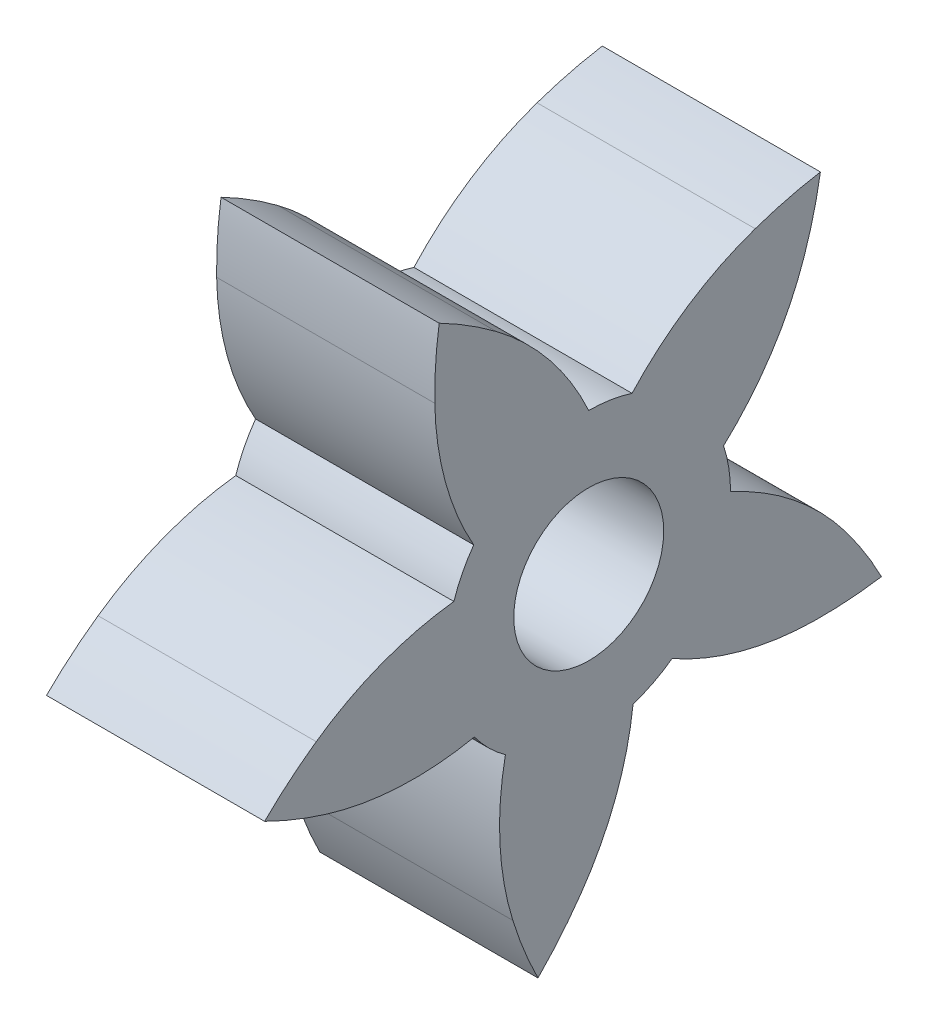
ISO-10303-21;
HEADER;
FILE_DESCRIPTION(('STEP AP214'),'2;1');
FILE_NAME('part.step','',(''),(''),'','','');
FILE_SCHEMA(('AUTOMOTIVE_DESIGN { 1 0 10303 214 1 1 1 1 }'));
ENDSEC;
DATA;
#1=APPLICATION_CONTEXT('core data for automotive mechanical design processes');
#2=APPLICATION_PROTOCOL_DEFINITION('international standard','automotive_design',2000,#1);
#3=PRODUCT_CONTEXT('',#1,'mechanical');
#4=PRODUCT('Part','Part','',(#3));
#5=PRODUCT_RELATED_PRODUCT_CATEGORY('part','',(#4));
#6=PRODUCT_DEFINITION_FORMATION('','',#4);
#7=PRODUCT_DEFINITION_CONTEXT('part definition',#1,'design');
#8=PRODUCT_DEFINITION('design','',#6,#7);
#9=PRODUCT_DEFINITION_SHAPE('','',#8);
#10=(LENGTH_UNIT() NAMED_UNIT(*) SI_UNIT(.MILLI.,.METRE.));
#11=(NAMED_UNIT(*) PLANE_ANGLE_UNIT() SI_UNIT($,.RADIAN.));
#12=(NAMED_UNIT(*) SI_UNIT($,.STERADIAN.) SOLID_ANGLE_UNIT());
#13=UNCERTAINTY_MEASURE_WITH_UNIT(LENGTH_MEASURE(1.E-05),#10,'distance_accuracy_value','');
#14=(GEOMETRIC_REPRESENTATION_CONTEXT(3) GLOBAL_UNCERTAINTY_ASSIGNED_CONTEXT((#13)) GLOBAL_UNIT_ASSIGNED_CONTEXT((#10,
#11,#12)) REPRESENTATION_CONTEXT('',''));
#15=CARTESIAN_POINT('',(0.,0.,0.));
#16=DIRECTION('',(0.,0.,1.));
#17=DIRECTION('',(1.,0.,0.));
#18=AXIS2_PLACEMENT_3D('',#15,#16,#17);
#19=CARTESIAN_POINT('',(-4.,-5.97317024184142,-10.9089907349344));
#20=DIRECTION('',(1.,0.,0.));
#21=DIRECTION('',(0.,0.,-1.));
#22=AXIS2_PLACEMENT_3D('',#19,#20,#21);
#23=CYLINDRICAL_SURFACE('',#22,14.7008999465529);
#24=DIRECTION('',(1.,0.,0.));
#25=VECTOR('',#24,1.);
#26=CARTESIAN_POINT('',(-4.,7.92049634769369,-6.10456694665368));
#27=LINE('',#26,#25);
#28=CARTESIAN_POINT('',(-4.,7.92049634769369,-6.10456694665368));
#29=VERTEX_POINT('',#28);
#30=CARTESIAN_POINT('',(4.,7.92049634769369,-6.10456694665368));
#31=VERTEX_POINT('',#30);
#32=EDGE_CURVE('E36',#29,#31,#27,.T.);
#33=ORIENTED_EDGE('',*,*,#32,.T.);
#34=CARTESIAN_POINT('',(4.,-5.97317024184142,-10.9089907349344));
#35=DIRECTION('',(1.,0.,0.));
#36=DIRECTION('',(0.,0.,1.));
#37=AXIS2_PLACEMENT_3D('',#34,#35,#36);
#38=CIRCLE('',#37,14.7008999465529);
#39=CARTESIAN_POINT('',(4.,8.5284493631852,-8.49662922188018));
#40=VERTEX_POINT('',#39);
#41=EDGE_CURVE('E199',#40,#31,#38,.T.);
#42=ORIENTED_EDGE('',*,*,#41,.F.);
#43=DIRECTION('',(1.,0.,0.));
#44=VECTOR('',#43,1.);
#45=CARTESIAN_POINT('',(-4.,8.5284493631852,-8.49662922188018));
#46=LINE('',#45,#44);
#47=CARTESIAN_POINT('',(-4.,8.5284493631852,-8.49662922188018));
#48=VERTEX_POINT('',#47);
#49=EDGE_CURVE('E11',#48,#40,#46,.T.);
#50=ORIENTED_EDGE('',*,*,#49,.F.);
#51=CARTESIAN_POINT('',(-4.,-5.97317024184142,-10.9089907349344));
#52=DIRECTION('',(1.,0.,0.));
#53=DIRECTION('',(0.,0.,1.));
#54=AXIS2_PLACEMENT_3D('',#51,#52,#53);
#55=CIRCLE('',#54,14.7008999465529);
#56=EDGE_CURVE('E200',#48,#29,#55,.T.);
#57=ORIENTED_EDGE('',*,*,#56,.T.);
#58=EDGE_LOOP('',(#33,#42,#50,#57));
#59=FACE_BOUND('',#58,.T.);
#60=ADVANCED_FACE('F33',(#59),#23,.T.);
#61=CARTESIAN_POINT('',(-4.,10.8865866987636,6.0139065209899));
#62=DIRECTION('',(1.,0.,0.));
#63=DIRECTION('',(0.,0.,-1.));
#64=AXIS2_PLACEMENT_3D('',#61,#62,#63);
#65=CYLINDRICAL_SURFACE('',#64,14.7008999465529);
#66=ORIENTED_EDGE('',*,*,#49,.T.);
#67=CARTESIAN_POINT('',(4.,10.8865866987636,6.0139065209899));
#68=DIRECTION('',(1.,0.,0.));
#69=DIRECTION('',(0.,0.,-1.));
#70=AXIS2_PLACEMENT_3D('',#67,#68,#69);
#71=CIRCLE('',#70,14.7008999465529);
#72=CARTESIAN_POINT('',(4.,6.1341312602249,-7.89762202706193));
#73=VERTEX_POINT('',#72);
#74=EDGE_CURVE('E218',#73,#40,#71,.T.);
#75=ORIENTED_EDGE('',*,*,#74,.F.);
#76=DIRECTION('',(1.,0.,0.));
#77=VECTOR('',#76,1.);
#78=CARTESIAN_POINT('',(-4.,6.1341312602249,-7.89762202706193));
#79=LINE('',#78,#77);
#80=CARTESIAN_POINT('',(-4.,6.1341312602249,-7.89762202706193));
#81=VERTEX_POINT('',#80);
#82=EDGE_CURVE('E41',#81,#73,#79,.T.);
#83=ORIENTED_EDGE('',*,*,#82,.F.);
#84=CARTESIAN_POINT('',(-4.,10.8865866987636,6.0139065209899));
#85=DIRECTION('',(1.,0.,0.));
#86=DIRECTION('',(0.,0.,-1.));
#87=AXIS2_PLACEMENT_3D('',#84,#85,#86);
#88=CIRCLE('',#87,14.7008999465529);
#89=EDGE_CURVE('E205',#81,#48,#88,.T.);
#90=ORIENTED_EDGE('',*,*,#89,.T.);
#91=EDGE_LOOP('',(#66,#75,#83,#90));
#92=FACE_BOUND('',#91,.T.);
#93=ADVANCED_FACE('F492',(#92),#65,.T.);
#94=CARTESIAN_POINT('',(-4.,9.68405324180499,2.4938149109124));
#95=DIRECTION('',(1.,0.,0.));
#96=DIRECTION('',(0.,0.,-1.));
#97=AXIS2_PLACEMENT_3D('',#94,#95,#96);
#98=CYLINDRICAL_SURFACE('',#97,10.981070426475);
#99=ORIENTED_EDGE('',*,*,#82,.T.);
#100=CARTESIAN_POINT('',(4.,9.68405324180499,2.4938149109124));
#101=DIRECTION('',(1.,0.,0.));
#102=DIRECTION('',(0.,0.,-1.));
#103=AXIS2_PLACEMENT_3D('',#100,#101,#102);
#104=CIRCLE('',#103,10.981070426475);
#105=CARTESIAN_POINT('',(4.,1.60688837074984,-4.94549388473479));
#106=VERTEX_POINT('',#105);
#107=EDGE_CURVE('E285',#106,#73,#104,.T.);
#108=ORIENTED_EDGE('',*,*,#107,.F.);
#109=DIRECTION('',(1.,0.,0.));
#110=VECTOR('',#109,1.);
#111=CARTESIAN_POINT('',(-4.,1.60688837074984,-4.94549388473479));
#112=LINE('',#111,#110);
#113=CARTESIAN_POINT('',(-4.,1.60688837074984,-4.94549388473479));
#114=VERTEX_POINT('',#113);
#115=EDGE_CURVE('E361',#114,#106,#112,.T.);
#116=ORIENTED_EDGE('',*,*,#115,.F.);
#117=CARTESIAN_POINT('',(-4.,9.68405324180499,2.4938149109124));
#118=DIRECTION('',(1.,0.,0.));
#119=DIRECTION('',(0.,0.,-1.));
#120=AXIS2_PLACEMENT_3D('',#117,#118,#119);
#121=CIRCLE('',#120,10.981070426475);
#122=EDGE_CURVE('E357',#114,#81,#121,.T.);
#123=ORIENTED_EDGE('',*,*,#122,.T.);
#124=EDGE_LOOP('',(#99,#108,#116,#123));
#125=FACE_BOUND('',#124,.T.);
#126=ADVANCED_FACE('F490',(#125),#98,.T.);
#127=CARTESIAN_POINT('',(-4.,0.,0.));
#128=DIRECTION('',(1.,0.,0.));
#129=DIRECTION('',(0.,0.,-1.));
#130=AXIS2_PLACEMENT_3D('',#127,#128,#129);
#131=CYLINDRICAL_SURFACE('',#130,5.20000000000003);
#132=ORIENTED_EDGE('',*,*,#115,.T.);
#133=CARTESIAN_POINT('',(4.,0.,0.));
#134=DIRECTION('',(1.,0.,0.));
#135=DIRECTION('',(0.,0.,-1.));
#136=AXIS2_PLACEMENT_3D('',#133,#134,#135);
#137=CIRCLE('',#136,5.20000000000003);
#138=CARTESIAN_POINT('',(4.,0.0194376966845804,-5.19996367063729));
#139=VERTEX_POINT('',#138);
#140=EDGE_CURVE('E282',#139,#106,#137,.T.);
#141=ORIENTED_EDGE('',*,*,#140,.F.);
#142=DIRECTION('',(1.,0.,0.));
#143=VECTOR('',#142,1.);
#144=CARTESIAN_POINT('',(-4.,0.0194376966845804,-5.19996367063729));
#145=LINE('',#144,#143);
#146=CARTESIAN_POINT('',(-4.,0.0194376966845804,-5.19996367063729));
#147=VERTEX_POINT('',#146);
#148=EDGE_CURVE('E363',#147,#139,#145,.T.);
#149=ORIENTED_EDGE('',*,*,#148,.F.);
#150=CARTESIAN_POINT('',(-4.,0.,0.));
#151=DIRECTION('',(1.,0.,0.));
#152=DIRECTION('',(0.,0.,-1.));
#153=AXIS2_PLACEMENT_3D('',#150,#151,#152);
#154=CIRCLE('',#153,5.20000000000003);
#155=EDGE_CURVE('E354',#147,#114,#154,.T.);
#156=ORIENTED_EDGE('',*,*,#155,.T.);
#157=EDGE_LOOP('',(#132,#141,#149,#156));
#158=FACE_BOUND('',#157,.T.);
#159=ADVANCED_FACE('F486',(#158),#131,.T.);
#160=CARTESIAN_POINT('',(-4.,-9.97832291855498,-0.658081858924321));
#161=DIRECTION('',(1.,0.,0.));
#162=DIRECTION('',(0.,0.,-1.));
#163=AXIS2_PLACEMENT_3D('',#160,#161,#162);
#164=CYLINDRICAL_SURFACE('',#163,10.981070426475);
#165=ORIENTED_EDGE('',*,*,#148,.T.);
#166=CARTESIAN_POINT('',(4.,-9.97832291855498,-0.658081858924321));
#167=DIRECTION('',(1.,0.,0.));
#168=DIRECTION('',(0.,0.,-1.));
#169=AXIS2_PLACEMENT_3D('',#166,#167,#168);
#170=CIRCLE('',#169,10.981070426475);
#171=CARTESIAN_POINT('',(4.,-3.35822019845297,-9.4192545935816));
#172=VERTEX_POINT('',#171);
#173=EDGE_CURVE('E279',#172,#139,#170,.T.);
#174=ORIENTED_EDGE('',*,*,#173,.F.);
#175=DIRECTION('',(1.,0.,0.));
#176=VECTOR('',#175,1.);
#177=CARTESIAN_POINT('',(-4.,-3.35822019845297,-9.4192545935816));
#178=LINE('',#177,#176);
#179=CARTESIAN_POINT('',(-4.,-3.35822019845297,-9.4192545935816));
#180=VERTEX_POINT('',#179);
#181=EDGE_CURVE('E365',#180,#172,#178,.T.);
#182=ORIENTED_EDGE('',*,*,#181,.F.);
#183=CARTESIAN_POINT('',(-4.,-9.97832291855498,-0.658081858924321));
#184=DIRECTION('',(1.,0.,0.));
#185=DIRECTION('',(0.,0.,-1.));
#186=AXIS2_PLACEMENT_3D('',#183,#184,#185);
#187=CIRCLE('',#186,10.981070426475);
#188=EDGE_CURVE('E351',#180,#147,#187,.T.);
#189=ORIENTED_EDGE('',*,*,#188,.T.);
#190=EDGE_LOOP('',(#165,#174,#182,#189));
#191=FACE_BOUND('',#190,.T.);
#192=ADVANCED_FACE('F484',(#191),#164,.T.);
#193=CARTESIAN_POINT('',(-4.,-12.2208778396866,2.30975895286985));
#194=DIRECTION('',(1.,0.,0.));
#195=DIRECTION('',(0.,0.,-1.));
#196=AXIS2_PLACEMENT_3D('',#193,#194,#195);
#197=CYLINDRICAL_SURFACE('',#196,14.7008999465529);
#198=ORIENTED_EDGE('',*,*,#181,.T.);
#199=CARTESIAN_POINT('',(4.,-12.2208778396866,2.30975895286985));
#200=DIRECTION('',(1.,0.,0.));
#201=DIRECTION('',(0.,0.,1.));
#202=AXIS2_PLACEMENT_3D('',#199,#200,#201);
#203=CIRCLE('',#202,14.7008999465529);
#204=CARTESIAN_POINT('',(4.,-5.44533879912242,-10.7366401652144));
#205=VERTEX_POINT('',#204);
#206=EDGE_CURVE('E276',#205,#172,#203,.T.);
#207=ORIENTED_EDGE('',*,*,#206,.F.);
#208=DIRECTION('',(1.,0.,0.));
#209=VECTOR('',#208,1.);
#210=CARTESIAN_POINT('',(-4.,-5.44533879912242,-10.7366401652144));
#211=LINE('',#210,#209);
#212=CARTESIAN_POINT('',(-4.,-5.44533879912242,-10.7366401652144));
#213=VERTEX_POINT('',#212);
#214=EDGE_CURVE('E367',#213,#205,#211,.T.);
#215=ORIENTED_EDGE('',*,*,#214,.F.);
#216=CARTESIAN_POINT('',(-4.,-12.2208778396866,2.30975895286985));
#217=DIRECTION('',(1.,0.,0.));
#218=DIRECTION('',(0.,0.,1.));
#219=AXIS2_PLACEMENT_3D('',#216,#217,#218);
#220=CIRCLE('',#219,14.7008999465529);
#221=EDGE_CURVE('E348',#213,#180,#220,.T.);
#222=ORIENTED_EDGE('',*,*,#221,.T.);
#223=EDGE_LOOP('',(#198,#207,#215,#222));
#224=FACE_BOUND('',#223,.T.);
#225=ADVANCED_FACE('F479',(#224),#197,.T.);
#226=CARTESIAN_POINT('',(-4.,9.08370528583166,-8.49535990250298));
#227=DIRECTION('',(1.,0.,0.));
#228=DIRECTION('',(0.,0.,-1.));
#229=AXIS2_PLACEMENT_3D('',#226,#227,#228);
#230=CYLINDRICAL_SURFACE('',#229,14.7008999465529);
#231=ORIENTED_EDGE('',*,*,#214,.T.);
#232=CARTESIAN_POINT('',(4.,9.08370528583166,-8.49535990250298));
#233=DIRECTION('',(1.,0.,0.));
#234=DIRECTION('',(0.,0.,-1.));
#235=AXIS2_PLACEMENT_3D('',#232,#233,#234);
#236=CIRCLE('',#235,14.7008999465529);
#237=CARTESIAN_POINT('',(4.,-5.61553408693725,-8.27440492835881));
#238=VERTEX_POINT('',#237);
#239=EDGE_CURVE('E273',#238,#205,#236,.T.);
#240=ORIENTED_EDGE('',*,*,#239,.F.);
#241=DIRECTION('',(1.,0.,0.));
#242=VECTOR('',#241,1.);
#243=CARTESIAN_POINT('',(-4.,-5.61553408693725,-8.27440492835881));
#244=LINE('',#243,#242);
#245=CARTESIAN_POINT('',(-4.,-5.61553408693725,-8.27440492835881));
#246=VERTEX_POINT('',#245);
#247=EDGE_CURVE('E369',#246,#238,#244,.T.);
#248=ORIENTED_EDGE('',*,*,#247,.F.);
#249=CARTESIAN_POINT('',(-4.,9.08370528583166,-8.49535990250298));
#250=DIRECTION('',(1.,0.,0.));
#251=DIRECTION('',(0.,0.,-1.));
#252=AXIS2_PLACEMENT_3D('',#249,#250,#251);
#253=CIRCLE('',#252,14.7008999465529);
#254=EDGE_CURVE('E345',#246,#213,#253,.T.);
#255=ORIENTED_EDGE('',*,*,#254,.T.);
#256=EDGE_LOOP('',(#231,#240,#248,#255));
#257=FACE_BOUND('',#256,.T.);
#258=ADVANCED_FACE('F474',(#257),#230,.T.);
#259=CARTESIAN_POINT('',(-4.,5.3642959476069,-8.43945075147021));
#260=DIRECTION('',(1.,0.,0.));
#261=DIRECTION('',(0.,0.,-1.));
#262=AXIS2_PLACEMENT_3D('',#259,#260,#261);
#263=CYLINDRICAL_SURFACE('',#262,10.981070426475);
#264=ORIENTED_EDGE('',*,*,#247,.T.);
#265=CARTESIAN_POINT('',(4.,5.3642959476069,-8.43945075147021));
#266=DIRECTION('',(1.,0.,0.));
#267=DIRECTION('',(0.,0.,-1.));
#268=AXIS2_PLACEMENT_3D('',#265,#266,#267);
#269=CIRCLE('',#268,10.981070426475);
#270=CARTESIAN_POINT('',(4.,-4.20688837074973,-3.05648331192086));
#271=VERTEX_POINT('',#270);
#272=EDGE_CURVE('E270',#271,#238,#269,.T.);
#273=ORIENTED_EDGE('',*,*,#272,.F.);
#274=DIRECTION('',(1.,0.,0.));
#275=VECTOR('',#274,1.);
#276=CARTESIAN_POINT('',(-4.,-4.20688837074973,-3.05648331192086));
#277=LINE('',#276,#275);
#278=CARTESIAN_POINT('',(-4.,-4.20688837074973,-3.05648331192086));
#279=VERTEX_POINT('',#278);
#280=EDGE_CURVE('E371',#279,#271,#277,.T.);
#281=ORIENTED_EDGE('',*,*,#280,.F.);
#282=CARTESIAN_POINT('',(-4.,5.3642959476069,-8.43945075147021));
#283=DIRECTION('',(1.,0.,0.));
#284=DIRECTION('',(0.,0.,-1.));
#285=AXIS2_PLACEMENT_3D('',#282,#283,#284);
#286=CIRCLE('',#285,10.981070426475);
#287=EDGE_CURVE('E342',#279,#246,#286,.T.);
#288=ORIENTED_EDGE('',*,*,#287,.T.);
#289=EDGE_LOOP('',(#264,#273,#281,#288));
#290=FACE_BOUND('',#289,.T.);
#291=ADVANCED_FACE('F472',(#290),#263,.T.);
#292=CARTESIAN_POINT('',(-4.,0.,0.));
#293=DIRECTION('',(1.,0.,0.));
#294=DIRECTION('',(0.,0.,-1.));
#295=AXIS2_PLACEMENT_3D('',#292,#293,#294);
#296=CYLINDRICAL_SURFACE('',#295,5.2);
#297=ORIENTED_EDGE('',*,*,#280,.T.);
#298=CARTESIAN_POINT('',(4.,0.,0.));
#299=DIRECTION('',(1.,0.,0.));
#300=DIRECTION('',(0.,0.,-1.));
#301=AXIS2_PLACEMENT_3D('',#298,#299,#300);
#302=CIRCLE('',#301,5.2);
#303=CARTESIAN_POINT('',(4.,-4.93945275485065,-1.62536349245313));
#304=VERTEX_POINT('',#303);
#305=EDGE_CURVE('E267',#304,#271,#302,.T.);
#306=ORIENTED_EDGE('',*,*,#305,.F.);
#307=DIRECTION('',(1.,0.,0.));
#308=VECTOR('',#307,1.);
#309=CARTESIAN_POINT('',(-4.,-4.93945275485065,-1.62536349245313));
#310=LINE('',#309,#308);
#311=CARTESIAN_POINT('',(-4.,-4.93945275485065,-1.62536349245313));
#312=VERTEX_POINT('',#311);
#313=EDGE_CURVE('E373',#312,#304,#310,.T.);
#314=ORIENTED_EDGE('',*,*,#313,.F.);
#315=CARTESIAN_POINT('',(-4.,0.,0.));
#316=DIRECTION('',(1.,0.,0.));
#317=DIRECTION('',(0.,0.,-1.));
#318=AXIS2_PLACEMENT_3D('',#315,#316,#317);
#319=CIRCLE('',#318,5.2);
#320=EDGE_CURVE('E339',#312,#279,#319,.T.);
#321=ORIENTED_EDGE('',*,*,#320,.T.);
#322=EDGE_LOOP('',(#297,#306,#314,#321));
#323=FACE_BOUND('',#322,.T.);
#324=ADVANCED_FACE('F467',(#323),#296,.T.);
#325=CARTESIAN_POINT('',(-4.,-3.70934439738009,9.28659055529152));
#326=DIRECTION('',(1.,0.,0.));
#327=DIRECTION('',(0.,0.,-1.));
#328=AXIS2_PLACEMENT_3D('',#325,#326,#327);
#329=CYLINDRICAL_SURFACE('',#328,10.9810704264753);
#330=ORIENTED_EDGE('',*,*,#313,.T.);
#331=CARTESIAN_POINT('',(4.,-3.70934439738009,9.28659055529152));
#332=DIRECTION('',(1.,0.,0.));
#333=DIRECTION('',(0.,0.,-1.));
#334=AXIS2_PLACEMENT_3D('',#331,#332,#333);
#335=CIRCLE('',#334,10.9810704264753);
#336=CARTESIAN_POINT('',(4.,-9.99599057204389,0.283147459131331));
#337=VERTEX_POINT('',#336);
#338=EDGE_CURVE('E264',#337,#304,#335,.T.);
#339=ORIENTED_EDGE('',*,*,#338,.F.);
#340=DIRECTION('',(1.,0.,0.));
#341=VECTOR('',#340,1.);
#342=CARTESIAN_POINT('',(-4.,-9.99599057204389,0.283147459131331));
#343=LINE('',#342,#341);
#344=CARTESIAN_POINT('',(-4.,-9.99599057204389,0.283147459131331));
#345=VERTEX_POINT('',#344);
#346=EDGE_CURVE('E375',#345,#337,#343,.T.);
#347=ORIENTED_EDGE('',*,*,#346,.F.);
#348=CARTESIAN_POINT('',(-4.,-3.70934439738009,9.28659055529152));
#349=DIRECTION('',(1.,0.,0.));
#350=DIRECTION('',(0.,0.,-1.));
#351=AXIS2_PLACEMENT_3D('',#348,#349,#350);
#352=CIRCLE('',#351,10.9810704264753);
#353=EDGE_CURVE('E336',#345,#312,#352,.T.);
#354=ORIENTED_EDGE('',*,*,#353,.T.);
#355=EDGE_LOOP('',(#330,#339,#347,#354));
#356=FACE_BOUND('',#355,.T.);
#357=ADVANCED_FACE('F462',(#356),#329,.T.);
#358=CARTESIAN_POINT('',(-4.,-1.57974763544538,12.3365002736275));
#359=DIRECTION('',(1.,0.,0.));
#360=DIRECTION('',(0.,0.,-1.));
#361=AXIS2_PLACEMENT_3D('',#358,#359,#360);
#362=CYLINDRICAL_SURFACE('',#361,14.7008999465531);
#363=ORIENTED_EDGE('',*,*,#346,.T.);
#364=CARTESIAN_POINT('',(4.,-1.57974763544538,12.3365002736275));
#365=DIRECTION('',(1.,0.,0.));
#366=DIRECTION('',(0.,0.,1.));
#367=AXIS2_PLACEMENT_3D('',#364,#365,#366);
#368=CIRCLE('',#367,14.7008999465531);
#369=CARTESIAN_POINT('',(4.,-11.8938538213015,1.86102067480035));
#370=VERTEX_POINT('',#369);
#371=EDGE_CURVE('E261',#370,#337,#368,.T.);
#372=ORIENTED_EDGE('',*,*,#371,.F.);
#373=DIRECTION('',(1.,0.,0.));
#374=VECTOR('',#373,1.);
#375=CARTESIAN_POINT('',(-4.,-11.8938538213015,1.86102067480035));
#376=LINE('',#375,#374);
#377=CARTESIAN_POINT('',(-4.,-11.8938538213015,1.86102067480035));
#378=VERTEX_POINT('',#377);
#379=EDGE_CURVE('E377',#378,#370,#376,.T.);
#380=ORIENTED_EDGE('',*,*,#379,.F.);
#381=CARTESIAN_POINT('',(-4.,-1.57974763544538,12.3365002736275));
#382=DIRECTION('',(1.,0.,0.));
#383=DIRECTION('',(0.,0.,1.));
#384=AXIS2_PLACEMENT_3D('',#381,#382,#383);
#385=CIRCLE('',#384,14.7008999465531);
#386=EDGE_CURVE('E333',#378,#345,#385,.T.);
#387=ORIENTED_EDGE('',*,*,#386,.T.);
#388=EDGE_LOOP('',(#363,#372,#380,#387));
#389=FACE_BOUND('',#388,.T.);
#390=ADVANCED_FACE('F460',(#389),#362,.T.);
#391=CARTESIAN_POINT('',(-4.,-5.27254808833253,-11.2643276873998));
#392=DIRECTION('',(1.,0.,0.));
#393=DIRECTION('',(0.,0.,-1.));
#394=AXIS2_PLACEMENT_3D('',#391,#392,#393);
#395=CYLINDRICAL_SURFACE('',#394,14.7008999465529);
#396=ORIENTED_EDGE('',*,*,#379,.T.);
#397=CARTESIAN_POINT('',(4.,-5.27254808833253,-11.2643276873998));
#398=DIRECTION('',(1.,0.,0.));
#399=DIRECTION('',(0.,0.,-1.));
#400=AXIS2_PLACEMENT_3D('',#397,#398,#399);
#401=CIRCLE('',#400,14.7008999465529);
#402=CARTESIAN_POINT('',(4.,-9.60472219093579,2.78375854465655));
#403=VERTEX_POINT('',#402);
#404=EDGE_CURVE('E258',#403,#370,#401,.T.);
#405=ORIENTED_EDGE('',*,*,#404,.F.);
#406=DIRECTION('',(1.,0.,0.));
#407=VECTOR('',#406,1.);
#408=CARTESIAN_POINT('',(-4.,-9.60472219093579,2.78375854465655));
#409=LINE('',#408,#407);
#410=CARTESIAN_POINT('',(-4.,-9.60472219093579,2.78375854465655));
#411=VERTEX_POINT('',#410);
#412=EDGE_CURVE('E379',#411,#403,#409,.T.);
#413=ORIENTED_EDGE('',*,*,#412,.F.);
#414=CARTESIAN_POINT('',(-4.,-5.27254808833253,-11.2643276873998));
#415=DIRECTION('',(1.,0.,0.));
#416=DIRECTION('',(0.,0.,-1.));
#417=AXIS2_PLACEMENT_3D('',#414,#415,#416);
#418=CIRCLE('',#417,14.7008999465529);
#419=EDGE_CURVE('E330',#411,#378,#418,.T.);
#420=ORIENTED_EDGE('',*,*,#419,.T.);
#421=EDGE_LOOP('',(#396,#405,#413,#420));
#422=FACE_BOUND('',#421,.T.);
#423=ADVANCED_FACE('F455',(#422),#395,.T.);
#424=CARTESIAN_POINT('',(-4.,-6.3687360204706,-7.70968232170193));
#425=DIRECTION('',(1.,0.,0.));
#426=DIRECTION('',(0.,0.,-1.));
#427=AXIS2_PLACEMENT_3D('',#424,#425,#426);
#428=CYLINDRICAL_SURFACE('',#427,10.981070426475);
#429=ORIENTED_EDGE('',*,*,#412,.T.);
#430=CARTESIAN_POINT('',(4.,-6.3687360204706,-7.70968232170193));
#431=DIRECTION('',(1.,0.,0.));
#432=DIRECTION('',(0.,0.,-1.));
#433=AXIS2_PLACEMENT_3D('',#430,#431,#432);
#434=CIRCLE('',#433,10.981070426475);
#435=CARTESIAN_POINT('',(4.,-4.20688837074973,3.05648331192086));
#436=VERTEX_POINT('',#435);
#437=EDGE_CURVE('E255',#436,#403,#434,.T.);
#438=ORIENTED_EDGE('',*,*,#437,.F.);
#439=DIRECTION('',(1.,0.,0.));
#440=VECTOR('',#439,1.);
#441=CARTESIAN_POINT('',(-4.,-4.20688837074973,3.05648331192086));
#442=LINE('',#441,#440);
#443=CARTESIAN_POINT('',(-4.,-4.20688837074973,3.05648331192086));
#444=VERTEX_POINT('',#443);
#445=EDGE_CURVE('E381',#444,#436,#442,.T.);
#446=ORIENTED_EDGE('',*,*,#445,.F.);
#447=CARTESIAN_POINT('',(-4.,-6.3687360204706,-7.70968232170193));
#448=DIRECTION('',(1.,0.,0.));
#449=DIRECTION('',(0.,0.,-1.));
#450=AXIS2_PLACEMENT_3D('',#447,#448,#449);
#451=CIRCLE('',#450,10.981070426475);
#452=EDGE_CURVE('E327',#444,#411,#451,.T.);
#453=ORIENTED_EDGE('',*,*,#452,.T.);
#454=EDGE_LOOP('',(#429,#438,#446,#453));
#455=FACE_BOUND('',#454,.T.);
#456=ADVANCED_FACE('F450',(#455),#428,.T.);
#457=CARTESIAN_POINT('',(-4.,0.,0.));
#458=DIRECTION('',(1.,0.,0.));
#459=DIRECTION('',(0.,0.,-1.));
#460=AXIS2_PLACEMENT_3D('',#457,#458,#459);
#461=CYLINDRICAL_SURFACE('',#460,5.2);
#462=ORIENTED_EDGE('',*,*,#445,.T.);
#463=CARTESIAN_POINT('',(4.,0.,0.));
#464=DIRECTION('',(1.,0.,0.));
#465=DIRECTION('',(0.,0.,-1.));
#466=AXIS2_PLACEMENT_3D('',#463,#464,#465);
#467=CIRCLE('',#466,5.2);
#468=CARTESIAN_POINT('',(4.,-3.0721873850067,4.19543378822815));
#469=VERTEX_POINT('',#468);
#470=EDGE_CURVE('E252',#469,#436,#467,.T.);
#471=ORIENTED_EDGE('',*,*,#470,.F.);
#472=DIRECTION('',(1.,0.,0.));
#473=VECTOR('',#472,1.);
#474=CARTESIAN_POINT('',(-4.,-3.0721873850067,4.19543378822815));
#475=LINE('',#474,#473);
#476=CARTESIAN_POINT('',(-4.,-3.0721873850067,4.19543378822815));
#477=VERTEX_POINT('',#476);
#478=EDGE_CURVE('E383',#477,#469,#475,.T.);
#479=ORIENTED_EDGE('',*,*,#478,.F.);
#480=CARTESIAN_POINT('',(-4.,0.,0.));
#481=DIRECTION('',(1.,0.,0.));
#482=DIRECTION('',(0.,0.,-1.));
#483=AXIS2_PLACEMENT_3D('',#480,#481,#482);
#484=CIRCLE('',#483,5.2);
#485=EDGE_CURVE('E324',#477,#444,#484,.T.);
#486=ORIENTED_EDGE('',*,*,#485,.T.);
#487=EDGE_LOOP('',(#462,#471,#479,#486));
#488=FACE_BOUND('',#487,.T.);
#489=ADVANCED_FACE('F448',(#488),#461,.T.);
#490=CARTESIAN_POINT('',(-4.,7.68582200499488,6.39751046169762));
#491=DIRECTION('',(1.,0.,0.));
#492=DIRECTION('',(0.,0.,-1.));
#493=AXIS2_PLACEMENT_3D('',#490,#491,#492);
#494=CYLINDRICAL_SURFACE('',#493,10.9810704264749);
#495=ORIENTED_EDGE('',*,*,#478,.T.);
#496=CARTESIAN_POINT('',(4.,7.68582200499488,6.39751046169762));
#497=DIRECTION('',(1.,0.,0.));
#498=DIRECTION('',(0.,0.,-1.));
#499=AXIS2_PLACEMENT_3D('',#496,#497,#498);
#500=CIRCLE('',#499,10.9810704264749);
#501=CARTESIAN_POINT('',(4.,-2.81964172629391,9.5942493471525));
#502=VERTEX_POINT('',#501);
#503=EDGE_CURVE('E249',#502,#469,#500,.T.);
#504=ORIENTED_EDGE('',*,*,#503,.F.);
#505=DIRECTION('',(1.,0.,0.));
#506=VECTOR('',#505,1.);
#507=CARTESIAN_POINT('',(-4.,-2.81964172629391,9.5942493471525));
#508=LINE('',#507,#506);
#509=CARTESIAN_POINT('',(-4.,-2.81964172629391,9.5942493471525));
#510=VERTEX_POINT('',#509);
#511=EDGE_CURVE('E385',#510,#502,#508,.T.);
#512=ORIENTED_EDGE('',*,*,#511,.F.);
#513=CARTESIAN_POINT('',(-4.,7.68582200499488,6.39751046169762));
#514=DIRECTION('',(1.,0.,0.));
#515=DIRECTION('',(0.,0.,-1.));
#516=AXIS2_PLACEMENT_3D('',#513,#514,#515);
#517=CIRCLE('',#516,10.9810704264749);
#518=EDGE_CURVE('E321',#510,#477,#517,.T.);
#519=ORIENTED_EDGE('',*,*,#518,.T.);
#520=EDGE_LOOP('',(#495,#504,#512,#519));
#521=FACE_BOUND('',#520,.T.);
#522=ADVANCED_FACE('F443',(#521),#494,.T.);
#523=CARTESIAN_POINT('',(-4.,11.2445401073341,5.31461751845423));
#524=DIRECTION('',(1.,0.,0.));
#525=DIRECTION('',(0.,0.,-1.));
#526=AXIS2_PLACEMENT_3D('',#523,#524,#525);
#527=CYLINDRICAL_SURFACE('',#526,14.7008999465529);
#528=ORIENTED_EDGE('',*,*,#511,.T.);
#529=CARTESIAN_POINT('',(4.,11.2445401073341,5.31461751845423));
#530=DIRECTION('',(1.,0.,0.));
#531=DIRECTION('',(0.,0.,1.));
#532=AXIS2_PLACEMENT_3D('',#529,#530,#531);
#533=CIRCLE('',#532,14.7008999465529);
#534=CARTESIAN_POINT('',(4.,-1.90546711966466,11.8868141960072));
#535=VERTEX_POINT('',#534);
#536=EDGE_CURVE('E246',#535,#502,#533,.T.);
#537=ORIENTED_EDGE('',*,*,#536,.F.);
#538=DIRECTION('',(1.,0.,0.));
#539=VECTOR('',#538,1.);
#540=CARTESIAN_POINT('',(-4.,-1.90546711966466,11.8868141960072));
#541=LINE('',#540,#539);
#542=CARTESIAN_POINT('',(-4.,-1.90546711966466,11.8868141960072));
#543=VERTEX_POINT('',#542);
#544=EDGE_CURVE('E387',#543,#535,#541,.T.);
#545=ORIENTED_EDGE('',*,*,#544,.F.);
#546=CARTESIAN_POINT('',(-4.,11.2445401073341,5.31461751845423));
#547=DIRECTION('',(1.,0.,0.));
#548=DIRECTION('',(0.,0.,1.));
#549=AXIS2_PLACEMENT_3D('',#546,#547,#548);
#550=CIRCLE('',#549,14.7008999465529);
#551=EDGE_CURVE('E318',#543,#510,#550,.T.);
#552=ORIENTED_EDGE('',*,*,#551,.T.);
#553=EDGE_LOOP('',(#528,#537,#545,#552));
#554=FACE_BOUND('',#553,.T.);
#555=ADVANCED_FACE('F438',(#554),#527,.T.);
#556=CARTESIAN_POINT('',(-4.,-12.3423192117394,1.53362253127344));
#557=DIRECTION('',(1.,0.,0.));
#558=DIRECTION('',(0.,0.,-1.));
#559=AXIS2_PLACEMENT_3D('',#556,#557,#558);
#560=CYLINDRICAL_SURFACE('',#559,14.7008999465529);
#561=ORIENTED_EDGE('',*,*,#544,.T.);
#562=CARTESIAN_POINT('',(4.,-12.3423192117394,1.53362253127344));
#563=DIRECTION('',(1.,0.,0.));
#564=DIRECTION('',(0.,0.,-1.));
#565=AXIS2_PLACEMENT_3D('',#562,#563,#564);
#566=CIRCLE('',#565,14.7008999465529);
#567=CARTESIAN_POINT('',(4.,-0.320510679561388,9.99486232542949));
#568=VERTEX_POINT('',#567);
#569=EDGE_CURVE('E243',#568,#535,#566,.T.);
#570=ORIENTED_EDGE('',*,*,#569,.F.);
#571=DIRECTION('',(1.,0.,0.));
#572=VECTOR('',#571,1.);
#573=CARTESIAN_POINT('',(-4.,-0.320510679561388,9.99486232542949));
#574=LINE('',#573,#572);
#575=CARTESIAN_POINT('',(-4.,-0.320510679561388,9.99486232542949));
#576=VERTEX_POINT('',#575);
#577=EDGE_CURVE('E389',#576,#568,#574,.T.);
#578=ORIENTED_EDGE('',*,*,#577,.F.);
#579=CARTESIAN_POINT('',(-4.,-12.3423192117394,1.53362253127344));
#580=DIRECTION('',(1.,0.,0.));
#581=DIRECTION('',(0.,0.,-1.));
#582=AXIS2_PLACEMENT_3D('',#579,#580,#581);
#583=CIRCLE('',#582,14.7008999465529);
#584=EDGE_CURVE('E315',#576,#543,#583,.T.);
#585=ORIENTED_EDGE('',*,*,#584,.T.);
#586=EDGE_LOOP('',(#561,#570,#578,#585));
#587=FACE_BOUND('',#586,.T.);
#588=ADVANCED_FACE('F436',(#587),#560,.T.);
#589=CARTESIAN_POINT('',(-4.,-9.30039127363344,3.67460503419426));
#590=DIRECTION('',(1.,0.,0.));
#591=DIRECTION('',(0.,0.,-1.));
#592=AXIS2_PLACEMENT_3D('',#589,#590,#591);
#593=CYLINDRICAL_SURFACE('',#592,10.981070426475);
#594=ORIENTED_EDGE('',*,*,#577,.T.);
#595=CARTESIAN_POINT('',(4.,-9.30039127363344,3.67460503419426));
#596=DIRECTION('',(1.,0.,0.));
#597=DIRECTION('',(0.,0.,-1.));
#598=AXIS2_PLACEMENT_3D('',#595,#596,#597);
#599=CIRCLE('',#598,10.981070426475);
#600=CARTESIAN_POINT('',(4.,1.60688837074972,4.9454938847348));
#601=VERTEX_POINT('',#600);
#602=EDGE_CURVE('E240',#601,#568,#599,.T.);
#603=ORIENTED_EDGE('',*,*,#602,.F.);
#604=DIRECTION('',(1.,0.,0.));
#605=VECTOR('',#604,1.);
#606=CARTESIAN_POINT('',(-4.,1.60688837074972,4.9454938847348));
#607=LINE('',#606,#605);
#608=CARTESIAN_POINT('',(-4.,1.60688837074972,4.9454938847348));
#609=VERTEX_POINT('',#608);
#610=EDGE_CURVE('E391',#609,#601,#607,.T.);
#611=ORIENTED_EDGE('',*,*,#610,.F.);
#612=CARTESIAN_POINT('',(-4.,-9.30039127363344,3.67460503419426));
#613=DIRECTION('',(1.,0.,0.));
#614=DIRECTION('',(0.,0.,-1.));
#615=AXIS2_PLACEMENT_3D('',#612,#613,#614);
#616=CIRCLE('',#615,10.981070426475);
#617=EDGE_CURVE('E312',#609,#576,#616,.T.);
#618=ORIENTED_EDGE('',*,*,#617,.T.);
#619=EDGE_LOOP('',(#594,#603,#611,#618));
#620=FACE_BOUND('',#619,.T.);
#621=ADVANCED_FACE('F431',(#620),#593,.T.);
#622=CARTESIAN_POINT('',(-4.,0.,0.));
#623=DIRECTION('',(1.,0.,0.));
#624=DIRECTION('',(0.,0.,-1.));
#625=AXIS2_PLACEMENT_3D('',#622,#623,#624);
#626=CYLINDRICAL_SURFACE('',#625,5.2);
#627=ORIENTED_EDGE('',*,*,#610,.T.);
#628=CARTESIAN_POINT('',(4.,0.,0.));
#629=DIRECTION('',(1.,0.,0.));
#630=DIRECTION('',(0.,0.,-1.));
#631=AXIS2_PLACEMENT_3D('',#628,#629,#630);
#632=CIRCLE('',#631,5.2);
#633=CARTESIAN_POINT('',(4.,3.04073653110794,4.2182841711276));
#634=VERTEX_POINT('',#633);
#635=EDGE_CURVE('E237',#634,#601,#632,.T.);
#636=ORIENTED_EDGE('',*,*,#635,.F.);
#637=DIRECTION('',(1.,0.,0.));
#638=VECTOR('',#637,1.);
#639=CARTESIAN_POINT('',(-4.,3.04073653110794,4.2182841711276));
#640=LINE('',#639,#638);
#641=CARTESIAN_POINT('',(-4.,3.04073653110794,4.2182841711276));
#642=VERTEX_POINT('',#641);
#643=EDGE_CURVE('E393',#642,#634,#640,.T.);
#644=ORIENTED_EDGE('',*,*,#643,.F.);
#645=CARTESIAN_POINT('',(-4.,0.,0.));
#646=DIRECTION('',(1.,0.,0.));
#647=DIRECTION('',(0.,0.,-1.));
#648=AXIS2_PLACEMENT_3D('',#645,#646,#647);
#649=CIRCLE('',#648,5.2);
#650=EDGE_CURVE('E309',#642,#609,#649,.T.);
#651=ORIENTED_EDGE('',*,*,#650,.T.);
#652=EDGE_LOOP('',(#627,#636,#644,#651));
#653=FACE_BOUND('',#652,.T.);
#654=ADVANCED_FACE('F426',(#653),#626,.T.);
#655=CARTESIAN_POINT('',(-4.,8.45944362794889,-5.33271164657905));
#656=DIRECTION('',(1.,0.,0.));
#657=DIRECTION('',(0.,0.,-1.));
#658=AXIS2_PLACEMENT_3D('',#655,#656,#657);
#659=CYLINDRICAL_SURFACE('',#658,10.981070426475);
#660=ORIENTED_EDGE('',*,*,#643,.T.);
#661=CARTESIAN_POINT('',(4.,8.45944362794889,-5.33271164657905));
#662=DIRECTION('',(1.,0.,0.));
#663=DIRECTION('',(0.,0.,-1.));
#664=AXIS2_PLACEMENT_3D('',#661,#662,#663);
#665=CIRCLE('',#664,10.981070426475);
#666=CARTESIAN_POINT('',(4.,8.2533561490971,5.64642473395037));
#667=VERTEX_POINT('',#666);
#668=EDGE_CURVE('E234',#667,#634,#665,.T.);
#669=ORIENTED_EDGE('',*,*,#668,.F.);
#670=DIRECTION('',(1.,0.,0.));
#671=VECTOR('',#670,1.);
#672=CARTESIAN_POINT('',(-4.,8.2533561490971,5.64642473395037));
#673=LINE('',#672,#671);
#674=CARTESIAN_POINT('',(-4.,8.2533561490971,5.64642473395037));
#675=VERTEX_POINT('',#674);
#676=EDGE_CURVE('E395',#675,#667,#673,.T.);
#677=ORIENTED_EDGE('',*,*,#676,.F.);
#678=CARTESIAN_POINT('',(-4.,8.45944362794889,-5.33271164657905));
#679=DIRECTION('',(1.,0.,0.));
#680=DIRECTION('',(0.,0.,-1.));
#681=AXIS2_PLACEMENT_3D('',#678,#679,#680);
#682=CIRCLE('',#681,10.981070426475);
#683=EDGE_CURVE('E306',#675,#642,#682,.T.);
#684=ORIENTED_EDGE('',*,*,#683,.T.);
#685=EDGE_LOOP('',(#660,#669,#677,#684));
#686=FACE_BOUND('',#685,.T.);
#687=ADVANCED_FACE('F424',(#686),#659,.T.);
#688=CARTESIAN_POINT('',(-4.,8.52925560963917,-9.05188601001715));
#689=DIRECTION('',(1.,0.,0.));
#690=DIRECTION('',(0.,0.,-1.));
#691=AXIS2_PLACEMENT_3D('',#688,#689,#690);
#692=CYLINDRICAL_SURFACE('',#691,14.7008999465529);
#693=ORIENTED_EDGE('',*,*,#676,.T.);
#694=CARTESIAN_POINT('',(4.,8.52925560963917,-9.05188601001715));
#695=DIRECTION('',(1.,0.,0.));
#696=DIRECTION('',(0.,0.,1.));
#697=AXIS2_PLACEMENT_3D('',#694,#695,#696);
#698=CIRCLE('',#697,14.7008999465529);
#699=CARTESIAN_POINT('',(4.,10.7162103769034,5.48543451628681));
#700=VERTEX_POINT('',#699);
#701=EDGE_CURVE('E231',#700,#667,#698,.T.);
#702=ORIENTED_EDGE('',*,*,#701,.F.);
#703=DIRECTION('',(1.,0.,0.));
#704=VECTOR('',#703,1.);
#705=CARTESIAN_POINT('',(-4.,10.7162103769034,5.48543451628681));
#706=LINE('',#705,#704);
#707=CARTESIAN_POINT('',(-4.,10.7162103769034,5.48543451628681));
#708=VERTEX_POINT('',#707);
#709=EDGE_CURVE('E397',#708,#700,#706,.T.);
#710=ORIENTED_EDGE('',*,*,#709,.F.);
#711=CARTESIAN_POINT('',(-4.,8.52925560963917,-9.05188601001715));
#712=DIRECTION('',(1.,0.,0.));
#713=DIRECTION('',(0.,0.,1.));
#714=AXIS2_PLACEMENT_3D('',#711,#712,#713);
#715=CIRCLE('',#714,14.7008999465529);
#716=EDGE_CURVE('E303',#708,#675,#715,.T.);
#717=ORIENTED_EDGE('',*,*,#716,.T.);
#718=EDGE_LOOP('',(#693,#702,#710,#717));
#719=FACE_BOUND('',#718,.T.);
#720=ADVANCED_FACE('F419',(#719),#692,.T.);
#721=CARTESIAN_POINT('',(-4.,-2.35542468452318,12.2121585376395));
#722=DIRECTION('',(1.,0.,0.));
#723=DIRECTION('',(0.,0.,-1.));
#724=AXIS2_PLACEMENT_3D('',#721,#722,#723);
#725=CYLINDRICAL_SURFACE('',#724,14.7008999465529);
#726=ORIENTED_EDGE('',*,*,#709,.T.);
#727=CARTESIAN_POINT('',(4.,-2.35542468452318,12.2121585376395));
#728=DIRECTION('',(1.,0.,0.));
#729=DIRECTION('',(0.,0.,-1.));
#730=AXIS2_PLACEMENT_3D('',#727,#728,#729);
#731=CIRCLE('',#730,14.7008999465529);
#732=CARTESIAN_POINT('',(4.,9.40663569720949,3.39340608533466));
#733=VERTEX_POINT('',#732);
#734=EDGE_CURVE('E228',#733,#700,#731,.T.);
#735=ORIENTED_EDGE('',*,*,#734,.F.);
#736=DIRECTION('',(1.,0.,0.));
#737=VECTOR('',#736,1.);
#738=CARTESIAN_POINT('',(-4.,9.40663569720949,3.39340608533466));
#739=LINE('',#738,#737);
#740=CARTESIAN_POINT('',(-4.,9.40663569720949,3.39340608533466));
#741=VERTEX_POINT('',#740);
#742=EDGE_CURVE('E399',#741,#733,#739,.T.);
#743=ORIENTED_EDGE('',*,*,#742,.F.);
#744=CARTESIAN_POINT('',(-4.,-2.35542468452318,12.2121585376395));
#745=DIRECTION('',(1.,0.,0.));
#746=DIRECTION('',(0.,0.,-1.));
#747=AXIS2_PLACEMENT_3D('',#744,#745,#746);
#748=CIRCLE('',#747,14.7008999465529);
#749=EDGE_CURVE('E300',#741,#708,#748,.T.);
#750=ORIENTED_EDGE('',*,*,#749,.T.);
#751=EDGE_LOOP('',(#726,#735,#743,#750));
#752=FACE_BOUND('',#751,.T.);
#753=ADVANCED_FACE('F412',(#752),#725,.T.);
#754=CARTESIAN_POINT('',(-4.,0.620778104692262,9.98071312806542));
#755=DIRECTION('',(1.,0.,0.));
#756=DIRECTION('',(0.,0.,-1.));
#757=AXIS2_PLACEMENT_3D('',#754,#755,#756);
#758=CYLINDRICAL_SURFACE('',#757,10.981070426475);
#759=ORIENTED_EDGE('',*,*,#742,.T.);
#760=CARTESIAN_POINT('',(4.,0.620778104692262,9.98071312806542));
#761=DIRECTION('',(1.,0.,0.));
#762=DIRECTION('',(0.,0.,-1.));
#763=AXIS2_PLACEMENT_3D('',#760,#761,#762);
#764=CIRCLE('',#763,10.981070426475);
#765=CARTESIAN_POINT('',(4.,5.20000000000003,1.220725780669E-13));
#766=VERTEX_POINT('',#765);
#767=EDGE_CURVE('E225',#766,#733,#764,.T.);
#768=ORIENTED_EDGE('',*,*,#767,.F.);
#769=DIRECTION('',(1.,0.,0.));
#770=VECTOR('',#769,1.);
#771=CARTESIAN_POINT('',(-4.,5.20000000000003,1.220725780669E-13));
#772=LINE('',#771,#770);
#773=CARTESIAN_POINT('',(-4.,5.20000000000003,1.220725780669E-13));
#774=VERTEX_POINT('',#773);
#775=EDGE_CURVE('E401',#774,#766,#772,.T.);
#776=ORIENTED_EDGE('',*,*,#775,.F.);
#777=CARTESIAN_POINT('',(-4.,0.620778104692262,9.98071312806542));
#778=DIRECTION('',(1.,0.,0.));
#779=DIRECTION('',(0.,0.,-1.));
#780=AXIS2_PLACEMENT_3D('',#777,#778,#779);
#781=CIRCLE('',#780,10.981070426475);
#782=EDGE_CURVE('E297',#774,#741,#781,.T.);
#783=ORIENTED_EDGE('',*,*,#782,.T.);
#784=EDGE_LOOP('',(#759,#768,#776,#783));
#785=FACE_BOUND('',#784,.T.);
#786=ADVANCED_FACE('F409',(#785),#758,.T.);
#787=CARTESIAN_POINT('',(-4.,0.,0.));
#788=DIRECTION('',(1.,0.,0.));
#789=DIRECTION('',(0.,0.,-1.));
#790=AXIS2_PLACEMENT_3D('',#787,#788,#789);
#791=CYLINDRICAL_SURFACE('',#790,5.20000000000003);
#792=ORIENTED_EDGE('',*,*,#775,.T.);
#793=CARTESIAN_POINT('',(4.,0.,0.));
#794=DIRECTION('',(1.,0.,0.));
#795=DIRECTION('',(0.,0.,-1.));
#796=AXIS2_PLACEMENT_3D('',#793,#794,#795);
#797=CIRCLE('',#796,5.20000000000003);
#798=CARTESIAN_POINT('',(4.,4.9514659120647,-1.5883907962656));
#799=VERTEX_POINT('',#798);
#800=EDGE_CURVE('E212',#799,#766,#797,.T.);
#801=ORIENTED_EDGE('',*,*,#800,.F.);
#802=DIRECTION('',(1.,0.,0.));
#803=VECTOR('',#802,1.);
#804=CARTESIAN_POINT('',(-4.,4.9514659120647,-1.5883907962656));
#805=LINE('',#804,#803);
#806=CARTESIAN_POINT('',(-4.,4.9514659120647,-1.5883907962656));
#807=VERTEX_POINT('',#806);
#808=EDGE_CURVE('E204',#807,#799,#805,.T.);
#809=ORIENTED_EDGE('',*,*,#808,.F.);
#810=CARTESIAN_POINT('',(-4.,0.,0.));
#811=DIRECTION('',(1.,0.,0.));
#812=DIRECTION('',(0.,0.,-1.));
#813=AXIS2_PLACEMENT_3D('',#810,#811,#812);
#814=CIRCLE('',#813,5.20000000000003);
#815=EDGE_CURVE('E294',#807,#774,#814,.T.);
#816=ORIENTED_EDGE('',*,*,#815,.T.);
#817=EDGE_LOOP('',(#792,#801,#809,#816));
#818=FACE_BOUND('',#817,.T.);
#819=ADVANCED_FACE('F403',(#818),#791,.T.);
#820=CARTESIAN_POINT('',(-4.,-2.45759831700888,-9.69330751148646));
#821=DIRECTION('',(1.,0.,0.));
#822=DIRECTION('',(0.,0.,-1.));
#823=AXIS2_PLACEMENT_3D('',#820,#821,#822);
#824=CYLINDRICAL_SURFACE('',#823,10.981070426475);
#825=ORIENTED_EDGE('',*,*,#808,.T.);
#826=CARTESIAN_POINT('',(4.,-2.45759831700888,-9.69330751148646));
#827=DIRECTION('',(1.,0.,0.));
#828=DIRECTION('',(0.,0.,-1.));
#829=AXIS2_PLACEMENT_3D('',#826,#827,#828);
#830=CIRCLE('',#829,10.981070426475);
#831=EDGE_CURVE('E207',#31,#799,#830,.T.);
#832=ORIENTED_EDGE('',*,*,#831,.F.);
#833=ORIENTED_EDGE('',*,*,#32,.F.);
#834=CARTESIAN_POINT('',(-4.,-2.45759831700888,-9.69330751148646));
#835=DIRECTION('',(1.,0.,0.));
#836=DIRECTION('',(0.,0.,-1.));
#837=AXIS2_PLACEMENT_3D('',#834,#835,#836);
#838=CIRCLE('',#837,10.981070426475);
#839=EDGE_CURVE('E292',#29,#807,#838,.T.);
#840=ORIENTED_EDGE('',*,*,#839,.T.);
#841=EDGE_LOOP('',(#825,#832,#833,#840));
#842=FACE_BOUND('',#841,.T.);
#843=ADVANCED_FACE('F208',(#842),#824,.T.);
#844=CARTESIAN_POINT('',(-4.,2.4567082284611,-2.44754210697227));
#845=DIRECTION('',(-1.,0.,0.));
#846=DIRECTION('',(0.,0.,1.));
#847=AXIS2_PLACEMENT_3D('',#844,#845,#846);
#848=PLANE('',#847);
#849=CARTESIAN_POINT('',(-4.,0.,0.));
#850=DIRECTION('',(1.,0.,0.));
#851=DIRECTION('',(0.,0.,-1.));
#852=AXIS2_PLACEMENT_3D('',#849,#850,#851);
#853=CIRCLE('',#852,2.75);
#854=CARTESIAN_POINT('',(-4.,0.,-2.75));
#855=VERTEX_POINT('',#854);
#856=EDGE_CURVE('E288',#855,#855,#853,.T.);
#857=ORIENTED_EDGE('',*,*,#856,.T.);
#858=EDGE_LOOP('',(#857));
#859=FACE_BOUND('',#858,.T.);
#860=ORIENTED_EDGE('',*,*,#56,.F.);
#861=ORIENTED_EDGE('',*,*,#89,.F.);
#862=ORIENTED_EDGE('',*,*,#122,.F.);
#863=ORIENTED_EDGE('',*,*,#155,.F.);
#864=ORIENTED_EDGE('',*,*,#188,.F.);
#865=ORIENTED_EDGE('',*,*,#221,.F.);
#866=ORIENTED_EDGE('',*,*,#254,.F.);
#867=ORIENTED_EDGE('',*,*,#287,.F.);
#868=ORIENTED_EDGE('',*,*,#320,.F.);
#869=ORIENTED_EDGE('',*,*,#353,.F.);
#870=ORIENTED_EDGE('',*,*,#386,.F.);
#871=ORIENTED_EDGE('',*,*,#419,.F.);
#872=ORIENTED_EDGE('',*,*,#452,.F.);
#873=ORIENTED_EDGE('',*,*,#485,.F.);
#874=ORIENTED_EDGE('',*,*,#518,.F.);
#875=ORIENTED_EDGE('',*,*,#551,.F.);
#876=ORIENTED_EDGE('',*,*,#584,.F.);
#877=ORIENTED_EDGE('',*,*,#617,.F.);
#878=ORIENTED_EDGE('',*,*,#650,.F.);
#879=ORIENTED_EDGE('',*,*,#683,.F.);
#880=ORIENTED_EDGE('',*,*,#716,.F.);
#881=ORIENTED_EDGE('',*,*,#749,.F.);
#882=ORIENTED_EDGE('',*,*,#782,.F.);
#883=ORIENTED_EDGE('',*,*,#815,.F.);
#884=ORIENTED_EDGE('',*,*,#839,.F.);
#885=EDGE_LOOP('',(#860,#861,#862,#863,#864,#865,#866,#867,#868,#869,#870,#871,#872,#873,#874,
#875,#876,#877,#878,#879,#880,#881,#882,#883,#884));
#886=FACE_BOUND('',#885,.T.);
#887=ADVANCED_FACE('F415',(#859,#886),#848,.T.);
#888=CARTESIAN_POINT('',(-4.,0.,0.));
#889=DIRECTION('',(1.,0.,0.));
#890=DIRECTION('',(0.,0.,-1.));
#891=AXIS2_PLACEMENT_3D('',#888,#889,#890);
#892=CYLINDRICAL_SURFACE('',#891,2.75);
#893=ORIENTED_EDGE('',*,*,#856,.F.);
#894=EDGE_LOOP('',(#893));
#895=FACE_BOUND('',#894,.T.);
#896=CARTESIAN_POINT('',(4.,0.,0.));
#897=DIRECTION('',(1.,0.,0.));
#898=DIRECTION('',(0.,0.,-1.));
#899=AXIS2_PLACEMENT_3D('',#896,#897,#898);
#900=CIRCLE('',#899,2.75);
#901=CARTESIAN_POINT('',(4.,0.,-2.75));
#902=VERTEX_POINT('',#901);
#903=EDGE_CURVE('E219',#902,#902,#900,.T.);
#904=ORIENTED_EDGE('',*,*,#903,.T.);
#905=EDGE_LOOP('',(#904));
#906=FACE_BOUND('',#905,.T.);
#907=ADVANCED_FACE('F548',(#895,#906),#892,.F.);
#908=CARTESIAN_POINT('',(4.,2.4567082284611,-2.44754210697227));
#909=DIRECTION('',(-1.,0.,0.));
#910=DIRECTION('',(0.,0.,1.));
#911=AXIS2_PLACEMENT_3D('',#908,#909,#910);
#912=PLANE('',#911);
#913=ORIENTED_EDGE('',*,*,#41,.T.);
#914=ORIENTED_EDGE('',*,*,#831,.T.);
#915=ORIENTED_EDGE('',*,*,#800,.T.);
#916=ORIENTED_EDGE('',*,*,#767,.T.);
#917=ORIENTED_EDGE('',*,*,#734,.T.);
#918=ORIENTED_EDGE('',*,*,#701,.T.);
#919=ORIENTED_EDGE('',*,*,#668,.T.);
#920=ORIENTED_EDGE('',*,*,#635,.T.);
#921=ORIENTED_EDGE('',*,*,#602,.T.);
#922=ORIENTED_EDGE('',*,*,#569,.T.);
#923=ORIENTED_EDGE('',*,*,#536,.T.);
#924=ORIENTED_EDGE('',*,*,#503,.T.);
#925=ORIENTED_EDGE('',*,*,#470,.T.);
#926=ORIENTED_EDGE('',*,*,#437,.T.);
#927=ORIENTED_EDGE('',*,*,#404,.T.);
#928=ORIENTED_EDGE('',*,*,#371,.T.);
#929=ORIENTED_EDGE('',*,*,#338,.T.);
#930=ORIENTED_EDGE('',*,*,#305,.T.);
#931=ORIENTED_EDGE('',*,*,#272,.T.);
#932=ORIENTED_EDGE('',*,*,#239,.T.);
#933=ORIENTED_EDGE('',*,*,#206,.T.);
#934=ORIENTED_EDGE('',*,*,#173,.T.);
#935=ORIENTED_EDGE('',*,*,#140,.T.);
#936=ORIENTED_EDGE('',*,*,#107,.T.);
#937=ORIENTED_EDGE('',*,*,#74,.T.);
#938=EDGE_LOOP('',(#913,#914,#915,#916,#917,#918,#919,#920,#921,#922,#923,#924,#925,#926,#927,
#928,#929,#930,#931,#932,#933,#934,#935,#936,#937));
#939=FACE_BOUND('',#938,.T.);
#940=ORIENTED_EDGE('',*,*,#903,.F.);
#941=EDGE_LOOP('',(#940));
#942=FACE_BOUND('',#941,.T.);
#943=ADVANCED_FACE('F215',(#939,#942),#912,.F.);
#944=CLOSED_SHELL('',(#60,#93,#126,#159,#192,#225,#258,#291,#324,#357,#390,#423,#456,#489,#522,
#555,#588,#621,#654,#687,#720,#753,#786,#819,#843,#887,#907,#943));
#945=MANIFOLD_SOLID_BREP('B2',#944);
#946=ADVANCED_BREP_SHAPE_REPRESENTATION('',(#18,#945),#14);
#947=SHAPE_DEFINITION_REPRESENTATION(#9,#946);
ENDSEC;
END-ISO-10303-21;
